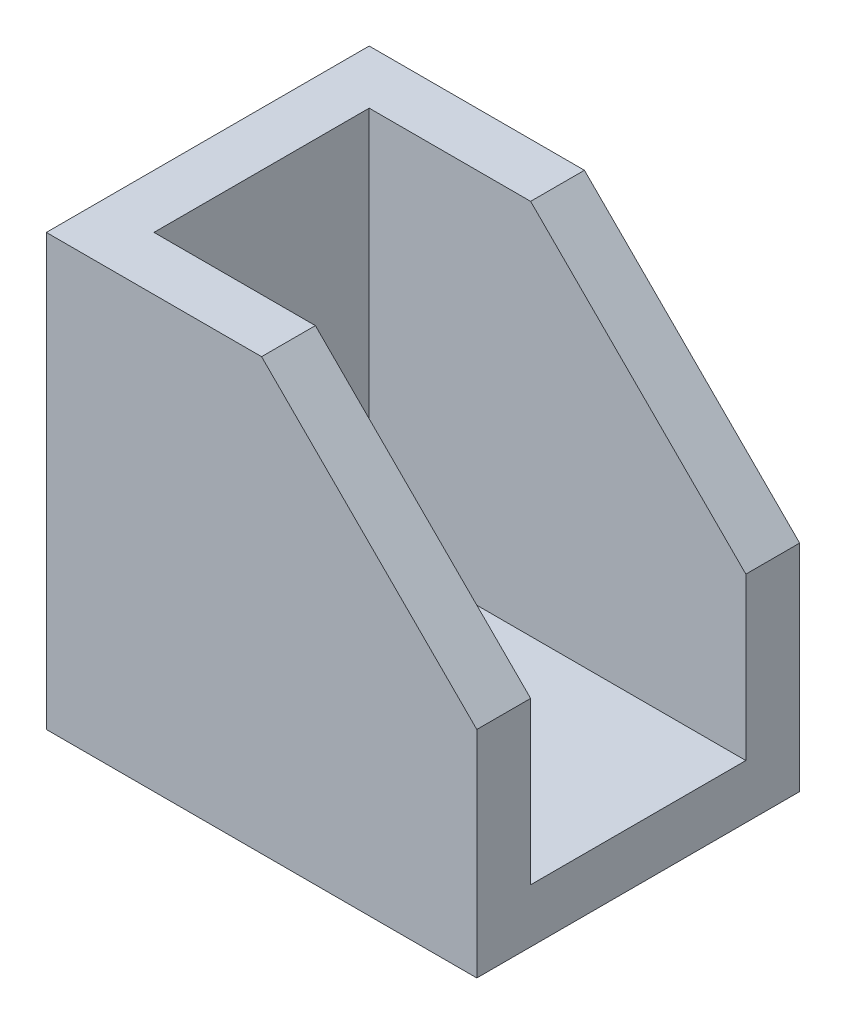
ISO-10303-21;
HEADER;
FILE_DESCRIPTION(('STEP AP214'),'2;1');
FILE_NAME('part.step','',(''),(''),'','','');
FILE_SCHEMA(('AUTOMOTIVE_DESIGN { 1 0 10303 214 1 1 1 1 }'));
ENDSEC;
DATA;
#1=APPLICATION_CONTEXT('core data for automotive mechanical design processes');
#2=APPLICATION_PROTOCOL_DEFINITION('international standard','automotive_design',2000,#1);
#3=PRODUCT_CONTEXT('',#1,'mechanical');
#4=PRODUCT('Part','Part','',(#3));
#5=PRODUCT_RELATED_PRODUCT_CATEGORY('part','',(#4));
#6=PRODUCT_DEFINITION_FORMATION('','',#4);
#7=PRODUCT_DEFINITION_CONTEXT('part definition',#1,'design');
#8=PRODUCT_DEFINITION('design','',#6,#7);
#9=PRODUCT_DEFINITION_SHAPE('','',#8);
#10=(LENGTH_UNIT() NAMED_UNIT(*) SI_UNIT(.MILLI.,.METRE.));
#11=(NAMED_UNIT(*) PLANE_ANGLE_UNIT() SI_UNIT($,.RADIAN.));
#12=(NAMED_UNIT(*) SI_UNIT($,.STERADIAN.) SOLID_ANGLE_UNIT());
#13=UNCERTAINTY_MEASURE_WITH_UNIT(LENGTH_MEASURE(1.E-05),#10,'distance_accuracy_value','');
#14=(GEOMETRIC_REPRESENTATION_CONTEXT(3) GLOBAL_UNCERTAINTY_ASSIGNED_CONTEXT((#13)) GLOBAL_UNIT_ASSIGNED_CONTEXT((#10,
#11,#12)) REPRESENTATION_CONTEXT('',''));
#15=CARTESIAN_POINT('',(0.,0.,0.));
#16=DIRECTION('',(0.,0.,1.));
#17=DIRECTION('',(1.,0.,0.));
#18=AXIS2_PLACEMENT_3D('',#15,#16,#17);
#19=CARTESIAN_POINT('',(20.,10.,15.));
#20=DIRECTION('',(-1.,0.,0.));
#21=DIRECTION('',(0.,0.,1.));
#22=AXIS2_PLACEMENT_3D('',#19,#20,#21);
#23=PLANE('',#22);
#24=DIRECTION('',(0.,1.,0.));
#25=VECTOR('',#24,1.);
#26=CARTESIAN_POINT('',(20.,0.,12.5));
#27=LINE('',#26,#25);
#28=CARTESIAN_POINT('',(20.,2.5,12.5));
#29=VERTEX_POINT('',#28);
#30=CARTESIAN_POINT('',(20.,10.,12.5));
#31=VERTEX_POINT('',#30);
#32=EDGE_CURVE('E210',#29,#31,#27,.T.);
#33=ORIENTED_EDGE('',*,*,#32,.T.);
#34=DIRECTION('',(0.,0.,-1.));
#35=VECTOR('',#34,1.);
#36=CARTESIAN_POINT('',(20.,10.,15.));
#37=LINE('',#36,#35);
#38=CARTESIAN_POINT('',(20.,10.,15.));
#39=VERTEX_POINT('',#38);
#40=EDGE_CURVE('E48',#39,#31,#37,.T.);
#41=ORIENTED_EDGE('',*,*,#40,.F.);
#42=DIRECTION('',(0.,1.,0.));
#43=VECTOR('',#42,1.);
#44=CARTESIAN_POINT('',(20.,10.,15.));
#45=LINE('',#44,#43);
#46=CARTESIAN_POINT('',(20.,0.,15.));
#47=VERTEX_POINT('',#46);
#48=EDGE_CURVE('E96',#47,#39,#45,.T.);
#49=ORIENTED_EDGE('',*,*,#48,.F.);
#50=DIRECTION('',(0.,0.,-1.));
#51=VECTOR('',#50,1.);
#52=CARTESIAN_POINT('',(20.,0.,15.));
#53=LINE('',#52,#51);
#54=CARTESIAN_POINT('',(20.,0.,0.));
#55=VERTEX_POINT('',#54);
#56=EDGE_CURVE('E11',#47,#55,#53,.T.);
#57=ORIENTED_EDGE('',*,*,#56,.T.);
#58=DIRECTION('',(0.,1.,0.));
#59=VECTOR('',#58,1.);
#60=CARTESIAN_POINT('',(20.,10.,0.));
#61=LINE('',#60,#59);
#62=CARTESIAN_POINT('',(20.,10.,0.));
#63=VERTEX_POINT('',#62);
#64=EDGE_CURVE('E137',#55,#63,#61,.T.);
#65=ORIENTED_EDGE('',*,*,#64,.T.);
#66=CARTESIAN_POINT('',(20.,10.,2.5));
#67=VERTEX_POINT('',#66);
#68=EDGE_CURVE('E121',#67,#63,#37,.T.);
#69=ORIENTED_EDGE('',*,*,#68,.F.);
#70=DIRECTION('',(0.,1.,0.));
#71=VECTOR('',#70,1.);
#72=CARTESIAN_POINT('',(20.,0.,2.5));
#73=LINE('',#72,#71);
#74=CARTESIAN_POINT('',(20.,2.5,2.5));
#75=VERTEX_POINT('',#74);
#76=EDGE_CURVE('E201',#75,#67,#73,.T.);
#77=ORIENTED_EDGE('',*,*,#76,.F.);
#78=DIRECTION('',(0.,0.,1.));
#79=VECTOR('',#78,1.);
#80=CARTESIAN_POINT('',(20.,2.5,0.));
#81=LINE('',#80,#79);
#82=EDGE_CURVE('E206',#75,#29,#81,.T.);
#83=ORIENTED_EDGE('',*,*,#82,.T.);
#84=EDGE_LOOP('',(#33,#41,#49,#57,#65,#69,#77,#83));
#85=FACE_BOUND('',#84,.T.);
#86=ADVANCED_FACE('F39',(#85),#23,.F.);
#87=CARTESIAN_POINT('',(10.,20.,15.));
#88=DIRECTION('',(-0.707106781186547,-0.707106781186547,0.));
#89=DIRECTION('',(0.707106781186548,-0.707106781186548,0.));
#90=AXIS2_PLACEMENT_3D('',#87,#88,#89);
#91=PLANE('',#90);
#92=DIRECTION('',(0.707106781186548,-0.707106781186548,0.));
#93=VECTOR('',#92,1.);
#94=CARTESIAN_POINT('',(10.,20.,12.5));
#95=LINE('',#94,#93);
#96=CARTESIAN_POINT('',(10.,20.,12.5));
#97=VERTEX_POINT('',#96);
#98=EDGE_CURVE('E117',#97,#31,#95,.T.);
#99=ORIENTED_EDGE('',*,*,#98,.F.);
#100=DIRECTION('',(0.,0.,-1.));
#101=VECTOR('',#100,1.);
#102=CARTESIAN_POINT('',(10.,20.,15.));
#103=LINE('',#102,#101);
#104=CARTESIAN_POINT('',(10.,20.,15.));
#105=VERTEX_POINT('',#104);
#106=EDGE_CURVE('E114',#105,#97,#103,.T.);
#107=ORIENTED_EDGE('',*,*,#106,.F.);
#108=DIRECTION('',(-0.707106781186548,0.707106781186548,0.));
#109=VECTOR('',#108,1.);
#110=CARTESIAN_POINT('',(10.,20.,15.));
#111=LINE('',#110,#109);
#112=EDGE_CURVE('E102',#39,#105,#111,.T.);
#113=ORIENTED_EDGE('',*,*,#112,.F.);
#114=ORIENTED_EDGE('',*,*,#40,.T.);
#115=EDGE_LOOP('',(#99,#107,#113,#114));
#116=FACE_BOUND('',#115,.T.);
#117=ADVANCED_FACE('F115',(#116),#91,.F.);
#118=CARTESIAN_POINT('',(0.,20.,15.));
#119=DIRECTION('',(0.,-1.,0.));
#120=DIRECTION('',(0.,0.,-1.));
#121=AXIS2_PLACEMENT_3D('',#118,#119,#120);
#122=PLANE('',#121);
#123=DIRECTION('',(1.,0.,0.));
#124=VECTOR('',#123,1.);
#125=CARTESIAN_POINT('',(2.5,20.,12.5));
#126=LINE('',#125,#124);
#127=CARTESIAN_POINT('',(2.5,20.,12.5));
#128=VERTEX_POINT('',#127);
#129=EDGE_CURVE('E185',#128,#97,#126,.T.);
#130=ORIENTED_EDGE('',*,*,#129,.F.);
#131=DIRECTION('',(0.,0.,-1.));
#132=VECTOR('',#131,1.);
#133=CARTESIAN_POINT('',(2.5,20.,0.));
#134=LINE('',#133,#132);
#135=CARTESIAN_POINT('',(2.5,20.,2.5));
#136=VERTEX_POINT('',#135);
#137=EDGE_CURVE('E191',#128,#136,#134,.T.);
#138=ORIENTED_EDGE('',*,*,#137,.T.);
#139=DIRECTION('',(1.,0.,0.));
#140=VECTOR('',#139,1.);
#141=CARTESIAN_POINT('',(2.5,20.,2.5));
#142=LINE('',#141,#140);
#143=CARTESIAN_POINT('',(10.,20.,2.5));
#144=VERTEX_POINT('',#143);
#145=EDGE_CURVE('E195',#136,#144,#142,.T.);
#146=ORIENTED_EDGE('',*,*,#145,.T.);
#147=CARTESIAN_POINT('',(10.,20.,0.));
#148=VERTEX_POINT('',#147);
#149=EDGE_CURVE('E122',#144,#148,#103,.T.);
#150=ORIENTED_EDGE('',*,*,#149,.T.);
#151=DIRECTION('',(-1.,0.,0.));
#152=VECTOR('',#151,1.);
#153=CARTESIAN_POINT('',(0.,20.,0.));
#154=LINE('',#153,#152);
#155=CARTESIAN_POINT('',(0.,20.,0.));
#156=VERTEX_POINT('',#155);
#157=EDGE_CURVE('E145',#148,#156,#154,.T.);
#158=ORIENTED_EDGE('',*,*,#157,.T.);
#159=DIRECTION('',(0.,0.,-1.));
#160=VECTOR('',#159,1.);
#161=CARTESIAN_POINT('',(0.,20.,15.));
#162=LINE('',#161,#160);
#163=CARTESIAN_POINT('',(0.,20.,15.));
#164=VERTEX_POINT('',#163);
#165=EDGE_CURVE('E125',#164,#156,#162,.T.);
#166=ORIENTED_EDGE('',*,*,#165,.F.);
#167=DIRECTION('',(-1.,0.,0.));
#168=VECTOR('',#167,1.);
#169=CARTESIAN_POINT('',(0.,20.,15.));
#170=LINE('',#169,#168);
#171=EDGE_CURVE('E106',#105,#164,#170,.T.);
#172=ORIENTED_EDGE('',*,*,#171,.F.);
#173=ORIENTED_EDGE('',*,*,#106,.T.);
#174=EDGE_LOOP('',(#130,#138,#146,#150,#158,#166,#172,#173));
#175=FACE_BOUND('',#174,.T.);
#176=ADVANCED_FACE('F124',(#175),#122,.F.);
#177=CARTESIAN_POINT('',(20.,0.,15.));
#178=DIRECTION('',(0.,1.,0.));
#179=DIRECTION('',(-1.,0.,0.));
#180=AXIS2_PLACEMENT_3D('',#177,#178,#179);
#181=PLANE('',#180);
#182=DIRECTION('',(1.,0.,0.));
#183=VECTOR('',#182,1.);
#184=CARTESIAN_POINT('',(20.,0.,0.));
#185=LINE('',#184,#183);
#186=CARTESIAN_POINT('',(0.,0.,0.));
#187=VERTEX_POINT('',#186);
#188=EDGE_CURVE('E133',#187,#55,#185,.T.);
#189=ORIENTED_EDGE('',*,*,#188,.T.);
#190=ORIENTED_EDGE('',*,*,#56,.F.);
#191=DIRECTION('',(1.,0.,0.));
#192=VECTOR('',#191,1.);
#193=CARTESIAN_POINT('',(20.,0.,15.));
#194=LINE('',#193,#192);
#195=CARTESIAN_POINT('',(0.,0.,15.));
#196=VERTEX_POINT('',#195);
#197=EDGE_CURVE('E150',#196,#47,#194,.T.);
#198=ORIENTED_EDGE('',*,*,#197,.F.);
#199=DIRECTION('',(0.,0.,-1.));
#200=VECTOR('',#199,1.);
#201=CARTESIAN_POINT('',(0.,0.,15.));
#202=LINE('',#201,#200);
#203=EDGE_CURVE('E129',#196,#187,#202,.T.);
#204=ORIENTED_EDGE('',*,*,#203,.T.);
#205=EDGE_LOOP('',(#189,#190,#198,#204));
#206=FACE_BOUND('',#205,.T.);
#207=ADVANCED_FACE('F41',(#206),#181,.F.);
#208=ORIENTED_EDGE('',*,*,#149,.F.);
#209=DIRECTION('',(0.707106781186548,-0.707106781186548,0.));
#210=VECTOR('',#209,1.);
#211=CARTESIAN_POINT('',(10.,20.,2.5));
#212=LINE('',#211,#210);
#213=EDGE_CURVE('E166',#144,#67,#212,.T.);
#214=ORIENTED_EDGE('',*,*,#213,.T.);
#215=ORIENTED_EDGE('',*,*,#68,.T.);
#216=DIRECTION('',(-0.707106781186548,0.707106781186548,0.));
#217=VECTOR('',#216,1.);
#218=CARTESIAN_POINT('',(10.,20.,0.));
#219=LINE('',#218,#217);
#220=EDGE_CURVE('E141',#63,#148,#219,.T.);
#221=ORIENTED_EDGE('',*,*,#220,.T.);
#222=EDGE_LOOP('',(#208,#214,#215,#221));
#223=FACE_BOUND('',#222,.T.);
#224=ADVANCED_FACE('F161',(#223),#91,.F.);
#225=CARTESIAN_POINT('',(0.,0.,15.));
#226=DIRECTION('',(1.,0.,0.));
#227=DIRECTION('',(0.,0.,-1.));
#228=AXIS2_PLACEMENT_3D('',#225,#226,#227);
#229=PLANE('',#228);
#230=DIRECTION('',(0.,-1.,0.));
#231=VECTOR('',#230,1.);
#232=CARTESIAN_POINT('',(0.,0.,0.));
#233=LINE('',#232,#231);
#234=EDGE_CURVE('E88',#156,#187,#233,.T.);
#235=ORIENTED_EDGE('',*,*,#234,.T.);
#236=ORIENTED_EDGE('',*,*,#203,.F.);
#237=DIRECTION('',(0.,-1.,0.));
#238=VECTOR('',#237,1.);
#239=CARTESIAN_POINT('',(0.,0.,15.));
#240=LINE('',#239,#238);
#241=EDGE_CURVE('E64',#164,#196,#240,.T.);
#242=ORIENTED_EDGE('',*,*,#241,.F.);
#243=ORIENTED_EDGE('',*,*,#165,.T.);
#244=EDGE_LOOP('',(#235,#236,#242,#243));
#245=FACE_BOUND('',#244,.T.);
#246=ADVANCED_FACE('F174',(#245),#229,.F.);
#247=CARTESIAN_POINT('',(0.,0.,15.));
#248=DIRECTION('',(0.,0.,-1.));
#249=DIRECTION('',(-1.,0.,0.));
#250=AXIS2_PLACEMENT_3D('',#247,#248,#249);
#251=PLANE('',#250);
#252=ORIENTED_EDGE('',*,*,#197,.T.);
#253=ORIENTED_EDGE('',*,*,#48,.T.);
#254=ORIENTED_EDGE('',*,*,#112,.T.);
#255=ORIENTED_EDGE('',*,*,#171,.T.);
#256=ORIENTED_EDGE('',*,*,#241,.T.);
#257=EDGE_LOOP('',(#252,#253,#254,#255,#256));
#258=FACE_BOUND('',#257,.T.);
#259=ADVANCED_FACE('F104',(#258),#251,.F.);
#260=CARTESIAN_POINT('',(0.,0.,0.));
#261=DIRECTION('',(0.,0.,-1.));
#262=DIRECTION('',(-1.,0.,0.));
#263=AXIS2_PLACEMENT_3D('',#260,#261,#262);
#264=PLANE('',#263);
#265=ORIENTED_EDGE('',*,*,#188,.F.);
#266=ORIENTED_EDGE('',*,*,#234,.F.);
#267=ORIENTED_EDGE('',*,*,#157,.F.);
#268=ORIENTED_EDGE('',*,*,#220,.F.);
#269=ORIENTED_EDGE('',*,*,#64,.F.);
#270=EDGE_LOOP('',(#265,#266,#267,#268,#269));
#271=FACE_BOUND('',#270,.T.);
#272=ADVANCED_FACE('F172',(#271),#264,.T.);
#273=CARTESIAN_POINT('',(2.5,0.,12.5));
#274=DIRECTION('',(0.,0.,-1.));
#275=DIRECTION('',(-1.,0.,0.));
#276=AXIS2_PLACEMENT_3D('',#273,#274,#275);
#277=PLANE('',#276);
#278=ORIENTED_EDGE('',*,*,#98,.T.);
#279=ORIENTED_EDGE('',*,*,#32,.F.);
#280=DIRECTION('',(1.,0.,0.));
#281=VECTOR('',#280,1.);
#282=CARTESIAN_POINT('',(2.5,2.5,12.5));
#283=LINE('',#282,#281);
#284=CARTESIAN_POINT('',(2.5,2.5,12.5));
#285=VERTEX_POINT('',#284);
#286=EDGE_CURVE('E186',#285,#29,#283,.T.);
#287=ORIENTED_EDGE('',*,*,#286,.F.);
#288=DIRECTION('',(0.,1.,0.));
#289=VECTOR('',#288,1.);
#290=CARTESIAN_POINT('',(2.5,0.,12.5));
#291=LINE('',#290,#289);
#292=EDGE_CURVE('E205',#285,#128,#291,.T.);
#293=ORIENTED_EDGE('',*,*,#292,.T.);
#294=ORIENTED_EDGE('',*,*,#129,.T.);
#295=EDGE_LOOP('',(#278,#279,#287,#293,#294));
#296=FACE_BOUND('',#295,.T.);
#297=ADVANCED_FACE('F228',(#296),#277,.T.);
#298=CARTESIAN_POINT('',(2.5,0.,2.5));
#299=DIRECTION('',(0.,0.,-1.));
#300=DIRECTION('',(-1.,0.,0.));
#301=AXIS2_PLACEMENT_3D('',#298,#299,#300);
#302=PLANE('',#301);
#303=ORIENTED_EDGE('',*,*,#145,.F.);
#304=DIRECTION('',(0.,1.,0.));
#305=VECTOR('',#304,1.);
#306=CARTESIAN_POINT('',(2.5,0.,2.5));
#307=LINE('',#306,#305);
#308=CARTESIAN_POINT('',(2.5,2.5,2.5));
#309=VERTEX_POINT('',#308);
#310=EDGE_CURVE('E55',#309,#136,#307,.T.);
#311=ORIENTED_EDGE('',*,*,#310,.F.);
#312=DIRECTION('',(1.,0.,0.));
#313=VECTOR('',#312,1.);
#314=CARTESIAN_POINT('',(2.5,2.5,2.5));
#315=LINE('',#314,#313);
#316=EDGE_CURVE('E190',#309,#75,#315,.T.);
#317=ORIENTED_EDGE('',*,*,#316,.T.);
#318=ORIENTED_EDGE('',*,*,#76,.T.);
#319=ORIENTED_EDGE('',*,*,#213,.F.);
#320=EDGE_LOOP('',(#303,#311,#317,#318,#319));
#321=FACE_BOUND('',#320,.T.);
#322=ADVANCED_FACE('F241',(#321),#302,.F.);
#323=CARTESIAN_POINT('',(2.5,2.5,0.));
#324=DIRECTION('',(0.,1.,0.));
#325=DIRECTION('',(0.,0.,1.));
#326=AXIS2_PLACEMENT_3D('',#323,#324,#325);
#327=PLANE('',#326);
#328=ORIENTED_EDGE('',*,*,#82,.F.);
#329=ORIENTED_EDGE('',*,*,#316,.F.);
#330=DIRECTION('',(0.,0.,1.));
#331=VECTOR('',#330,1.);
#332=CARTESIAN_POINT('',(2.5,2.5,0.));
#333=LINE('',#332,#331);
#334=EDGE_CURVE('E218',#309,#285,#333,.T.);
#335=ORIENTED_EDGE('',*,*,#334,.T.);
#336=ORIENTED_EDGE('',*,*,#286,.T.);
#337=EDGE_LOOP('',(#328,#329,#335,#336));
#338=FACE_BOUND('',#337,.T.);
#339=ADVANCED_FACE('F236',(#338),#327,.T.);
#340=CARTESIAN_POINT('',(2.5,0.,0.));
#341=DIRECTION('',(1.,0.,0.));
#342=DIRECTION('',(0.,0.,-1.));
#343=AXIS2_PLACEMENT_3D('',#340,#341,#342);
#344=PLANE('',#343);
#345=ORIENTED_EDGE('',*,*,#292,.F.);
#346=ORIENTED_EDGE('',*,*,#334,.F.);
#347=ORIENTED_EDGE('',*,*,#310,.T.);
#348=ORIENTED_EDGE('',*,*,#137,.F.);
#349=EDGE_LOOP('',(#345,#346,#347,#348));
#350=FACE_BOUND('',#349,.T.);
#351=ADVANCED_FACE('F234',(#350),#344,.T.);
#352=CLOSED_SHELL('',(#86,#117,#176,#207,#224,#246,#259,#272,#297,#322,#339,#351));
#353=MANIFOLD_SOLID_BREP('B2',#352);
#354=ADVANCED_BREP_SHAPE_REPRESENTATION('',(#18,#353),#14);
#355=SHAPE_DEFINITION_REPRESENTATION(#9,#354);
ENDSEC;
END-ISO-10303-21;
